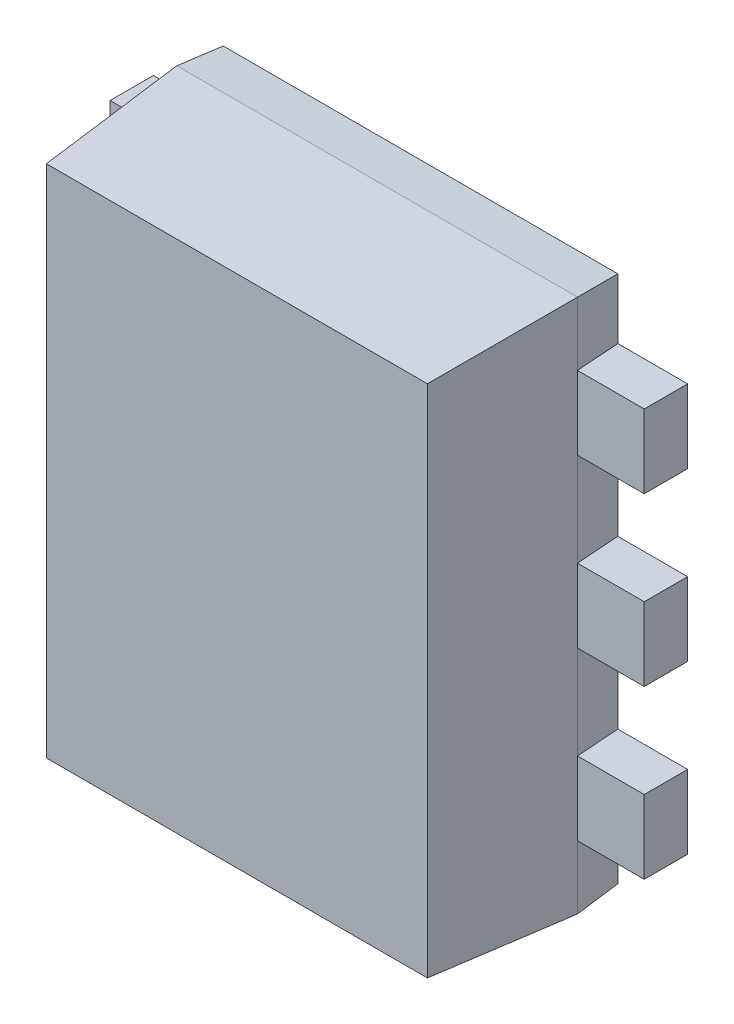
ISO-10303-21;
HEADER;
FILE_DESCRIPTION(('STEP AP214'),'2;1');
FILE_NAME('part.step','',(''),(''),'','','');
FILE_SCHEMA(('AUTOMOTIVE_DESIGN { 1 0 10303 214 1 1 1 1 }'));
ENDSEC;
DATA;
#1=APPLICATION_CONTEXT('core data for automotive mechanical design processes');
#2=APPLICATION_PROTOCOL_DEFINITION('international standard','automotive_design',2000,#1);
#3=PRODUCT_CONTEXT('',#1,'mechanical');
#4=PRODUCT('Part','Part','',(#3));
#5=PRODUCT_RELATED_PRODUCT_CATEGORY('part','',(#4));
#6=PRODUCT_DEFINITION_FORMATION('','',#4);
#7=PRODUCT_DEFINITION_CONTEXT('part definition',#1,'design');
#8=PRODUCT_DEFINITION('design','',#6,#7);
#9=PRODUCT_DEFINITION_SHAPE('','',#8);
#10=(LENGTH_UNIT() NAMED_UNIT(*) SI_UNIT(.MILLI.,.METRE.));
#11=(NAMED_UNIT(*) PLANE_ANGLE_UNIT() SI_UNIT($,.RADIAN.));
#12=(NAMED_UNIT(*) SI_UNIT($,.STERADIAN.) SOLID_ANGLE_UNIT());
#13=UNCERTAINTY_MEASURE_WITH_UNIT(LENGTH_MEASURE(1.E-05),#10,'distance_accuracy_value','');
#14=(GEOMETRIC_REPRESENTATION_CONTEXT(3) GLOBAL_UNCERTAINTY_ASSIGNED_CONTEXT((#13)) GLOBAL_UNIT_ASSIGNED_CONTEXT((#10,
#11,#12)) REPRESENTATION_CONTEXT('',''));
#15=CARTESIAN_POINT('',(0.,0.,0.));
#16=DIRECTION('',(0.,0.,1.));
#17=DIRECTION('',(1.,0.,0.));
#18=AXIS2_PLACEMENT_3D('',#15,#16,#17);
#19=CARTESIAN_POINT('',(0.590909514447,-0.61,0.13));
#20=DIRECTION('',(0.,0.,1.));
#21=DIRECTION('',(1.,0.,0.));
#22=AXIS2_PLACEMENT_3D('',#19,#20,#21);
#23=PLANE('',#22);
#24=DIRECTION('',(0.,1.,0.));
#25=VECTOR('',#24,1.);
#26=CARTESIAN_POINT('',(0.8,-0.61,0.13));
#27=LINE('',#26,#25);
#28=CARTESIAN_POINT('',(0.8,-0.39,0.13));
#29=VERTEX_POINT('',#28);
#30=CARTESIAN_POINT('',(0.8,-0.61,0.13));
#31=VERTEX_POINT('',#30);
#32=EDGE_CURVE('E358',#29,#31,#27,.F.);
#33=ORIENTED_EDGE('',*,*,#32,.F.);
#34=DIRECTION('',(-1.,0.,0.));
#35=VECTOR('',#34,1.);
#36=CARTESIAN_POINT('',(0.590909514447,-0.39,0.13));
#37=LINE('',#36,#35);
#38=CARTESIAN_POINT('',(0.6,-0.39,0.13));
#39=VERTEX_POINT('',#38);
#40=EDGE_CURVE('E367',#39,#29,#37,.F.);
#41=ORIENTED_EDGE('',*,*,#40,.F.);
#42=DIRECTION('',(0.,1.,0.));
#43=VECTOR('',#42,1.);
#44=CARTESIAN_POINT('',(0.6,0.,0.13));
#45=LINE('',#44,#43);
#46=CARTESIAN_POINT('',(0.6,-0.61,0.13));
#47=VERTEX_POINT('',#46);
#48=EDGE_CURVE('E339',#47,#39,#45,.T.);
#49=ORIENTED_EDGE('',*,*,#48,.F.);
#50=DIRECTION('',(-1.,0.,0.));
#51=VECTOR('',#50,1.);
#52=CARTESIAN_POINT('',(0.590909514447,-0.61,0.13));
#53=LINE('',#52,#51);
#54=EDGE_CURVE('E344',#47,#31,#53,.F.);
#55=ORIENTED_EDGE('',*,*,#54,.T.);
#56=EDGE_LOOP('',(#33,#41,#49,#55));
#57=FACE_BOUND('',#56,.T.);
#58=ADVANCED_FACE('F17',(#57),#23,.T.);
#59=CARTESIAN_POINT('',(0.590909514447,-0.11,0.13));
#60=DIRECTION('',(0.,0.,1.));
#61=DIRECTION('',(1.,0.,0.));
#62=AXIS2_PLACEMENT_3D('',#59,#60,#61);
#63=PLANE('',#62);
#64=DIRECTION('',(0.,1.,0.));
#65=VECTOR('',#64,1.);
#66=CARTESIAN_POINT('',(0.8,-0.11,0.13));
#67=LINE('',#66,#65);
#68=CARTESIAN_POINT('',(0.8,0.11,0.13));
#69=VERTEX_POINT('',#68);
#70=CARTESIAN_POINT('',(0.8,-0.11,0.13));
#71=VERTEX_POINT('',#70);
#72=EDGE_CURVE('E376',#69,#71,#67,.F.);
#73=ORIENTED_EDGE('',*,*,#72,.F.);
#74=DIRECTION('',(-1.,0.,0.));
#75=VECTOR('',#74,1.);
#76=CARTESIAN_POINT('',(0.590909514447,0.11,0.13));
#77=LINE('',#76,#75);
#78=CARTESIAN_POINT('',(0.6,0.11,0.13));
#79=VERTEX_POINT('',#78);
#80=EDGE_CURVE('E375',#79,#69,#77,.F.);
#81=ORIENTED_EDGE('',*,*,#80,.F.);
#82=DIRECTION('',(0.,1.,0.));
#83=VECTOR('',#82,1.);
#84=CARTESIAN_POINT('',(0.6,0.,0.13));
#85=LINE('',#84,#83);
#86=CARTESIAN_POINT('',(0.6,-0.11,0.13));
#87=VERTEX_POINT('',#86);
#88=EDGE_CURVE('E342',#87,#79,#85,.T.);
#89=ORIENTED_EDGE('',*,*,#88,.F.);
#90=DIRECTION('',(-1.,0.,0.));
#91=VECTOR('',#90,1.);
#92=CARTESIAN_POINT('',(0.590909514447,-0.11,0.13));
#93=LINE('',#92,#91);
#94=EDGE_CURVE('E359',#87,#71,#93,.F.);
#95=ORIENTED_EDGE('',*,*,#94,.T.);
#96=EDGE_LOOP('',(#73,#81,#89,#95));
#97=FACE_BOUND('',#96,.T.);
#98=ADVANCED_FACE('F572',(#97),#63,.T.);
#99=CARTESIAN_POINT('',(0.590909514447,0.39,0.13));
#100=DIRECTION('',(0.,0.,1.));
#101=DIRECTION('',(1.,0.,0.));
#102=AXIS2_PLACEMENT_3D('',#99,#100,#101);
#103=PLANE('',#102);
#104=DIRECTION('',(0.,1.,0.));
#105=VECTOR('',#104,1.);
#106=CARTESIAN_POINT('',(0.8,0.39,0.13));
#107=LINE('',#106,#105);
#108=CARTESIAN_POINT('',(0.8,0.61,0.13));
#109=VERTEX_POINT('',#108);
#110=CARTESIAN_POINT('',(0.8,0.39,0.13));
#111=VERTEX_POINT('',#110);
#112=EDGE_CURVE('E420',#109,#111,#107,.F.);
#113=ORIENTED_EDGE('',*,*,#112,.F.);
#114=DIRECTION('',(-1.,0.,0.));
#115=VECTOR('',#114,1.);
#116=CARTESIAN_POINT('',(0.590909514447,0.61,0.13));
#117=LINE('',#116,#115);
#118=CARTESIAN_POINT('',(0.6,0.61,0.13));
#119=VERTEX_POINT('',#118);
#120=EDGE_CURVE('E417',#119,#109,#117,.F.);
#121=ORIENTED_EDGE('',*,*,#120,.F.);
#122=DIRECTION('',(0.,1.,0.));
#123=VECTOR('',#122,1.);
#124=CARTESIAN_POINT('',(0.6,0.,0.13));
#125=LINE('',#124,#123);
#126=CARTESIAN_POINT('',(0.6,0.39,0.13));
#127=VERTEX_POINT('',#126);
#128=EDGE_CURVE('E322',#127,#119,#125,.T.);
#129=ORIENTED_EDGE('',*,*,#128,.F.);
#130=DIRECTION('',(-1.,0.,0.));
#131=VECTOR('',#130,1.);
#132=CARTESIAN_POINT('',(0.590909514447,0.39,0.13));
#133=LINE('',#132,#131);
#134=EDGE_CURVE('E397',#127,#111,#133,.F.);
#135=ORIENTED_EDGE('',*,*,#134,.T.);
#136=EDGE_LOOP('',(#113,#121,#129,#135));
#137=FACE_BOUND('',#136,.T.);
#138=ADVANCED_FACE('F622',(#137),#103,.T.);
#139=CARTESIAN_POINT('',(-0.590909514447,0.11,0.13));
#140=DIRECTION('',(0.,0.,1.));
#141=DIRECTION('',(1.,0.,0.));
#142=AXIS2_PLACEMENT_3D('',#139,#140,#141);
#143=PLANE('',#142);
#144=DIRECTION('',(0.,-1.,0.));
#145=VECTOR('',#144,1.);
#146=CARTESIAN_POINT('',(-0.8,0.11,0.13));
#147=LINE('',#146,#145);
#148=CARTESIAN_POINT('',(-0.8,-0.11,0.13));
#149=VERTEX_POINT('',#148);
#150=CARTESIAN_POINT('',(-0.8,0.11,0.13));
#151=VERTEX_POINT('',#150);
#152=EDGE_CURVE('E263',#149,#151,#147,.F.);
#153=ORIENTED_EDGE('',*,*,#152,.F.);
#154=DIRECTION('',(1.,0.,0.));
#155=VECTOR('',#154,1.);
#156=CARTESIAN_POINT('',(-0.590909514447,-0.11,0.13));
#157=LINE('',#156,#155);
#158=CARTESIAN_POINT('',(-0.6,-0.11,0.13));
#159=VERTEX_POINT('',#158);
#160=EDGE_CURVE('E262',#159,#149,#157,.F.);
#161=ORIENTED_EDGE('',*,*,#160,.F.);
#162=DIRECTION('',(0.,-1.,0.));
#163=VECTOR('',#162,1.);
#164=CARTESIAN_POINT('',(-0.6,0.,0.13));
#165=LINE('',#164,#163);
#166=CARTESIAN_POINT('',(-0.6,0.11,0.13));
#167=VERTEX_POINT('',#166);
#168=EDGE_CURVE('E215',#167,#159,#165,.T.);
#169=ORIENTED_EDGE('',*,*,#168,.F.);
#170=DIRECTION('',(1.,0.,0.));
#171=VECTOR('',#170,1.);
#172=CARTESIAN_POINT('',(-0.590909514447,0.11,0.13));
#173=LINE('',#172,#171);
#174=EDGE_CURVE('E261',#167,#151,#173,.F.);
#175=ORIENTED_EDGE('',*,*,#174,.T.);
#176=EDGE_LOOP('',(#153,#161,#169,#175));
#177=FACE_BOUND('',#176,.T.);
#178=ADVANCED_FACE('F967',(#177),#143,.T.);
#179=CARTESIAN_POINT('',(-0.590909514447,-0.39,0.13));
#180=DIRECTION('',(0.,0.,1.));
#181=DIRECTION('',(1.,0.,0.));
#182=AXIS2_PLACEMENT_3D('',#179,#180,#181);
#183=PLANE('',#182);
#184=DIRECTION('',(0.,-1.,0.));
#185=VECTOR('',#184,1.);
#186=CARTESIAN_POINT('',(-0.8,-0.39,0.13));
#187=LINE('',#186,#185);
#188=CARTESIAN_POINT('',(-0.8,-0.61,0.13));
#189=VERTEX_POINT('',#188);
#190=CARTESIAN_POINT('',(-0.8,-0.39,0.13));
#191=VERTEX_POINT('',#190);
#192=EDGE_CURVE('E309',#189,#191,#187,.F.);
#193=ORIENTED_EDGE('',*,*,#192,.F.);
#194=DIRECTION('',(1.,0.,0.));
#195=VECTOR('',#194,1.);
#196=CARTESIAN_POINT('',(-0.590909514447,-0.61,0.13));
#197=LINE('',#196,#195);
#198=CARTESIAN_POINT('',(-0.6,-0.61,0.13));
#199=VERTEX_POINT('',#198);
#200=EDGE_CURVE('E306',#199,#189,#197,.F.);
#201=ORIENTED_EDGE('',*,*,#200,.F.);
#202=DIRECTION('',(0.,-1.,0.));
#203=VECTOR('',#202,1.);
#204=CARTESIAN_POINT('',(-0.6,0.,0.13));
#205=LINE('',#204,#203);
#206=CARTESIAN_POINT('',(-0.6,-0.39,0.13));
#207=VERTEX_POINT('',#206);
#208=EDGE_CURVE('E282',#207,#199,#205,.T.);
#209=ORIENTED_EDGE('',*,*,#208,.F.);
#210=DIRECTION('',(1.,0.,0.));
#211=VECTOR('',#210,1.);
#212=CARTESIAN_POINT('',(-0.590909514447,-0.39,0.13));
#213=LINE('',#212,#211);
#214=EDGE_CURVE('E286',#207,#191,#213,.F.);
#215=ORIENTED_EDGE('',*,*,#214,.T.);
#216=EDGE_LOOP('',(#193,#201,#209,#215));
#217=FACE_BOUND('',#216,.T.);
#218=ADVANCED_FACE('F958',(#217),#183,.T.);
#219=CARTESIAN_POINT('',(-0.570630738984,0.770630738984,0.55));
#220=DIRECTION('',(0.,0.,-1.));
#221=DIRECTION('',(-1.,0.,0.));
#222=AXIS2_PLACEMENT_3D('',#219,#220,#221);
#223=PLANE('',#222);
#224=DIRECTION('',(-1.,0.,0.));
#225=VECTOR('',#224,1.);
#226=CARTESIAN_POINT('',(0.,-0.770630738984,0.55));
#227=LINE('',#226,#225);
#228=CARTESIAN_POINT('',(0.570630738984,-0.770630738984,0.55));
#229=VERTEX_POINT('',#228);
#230=CARTESIAN_POINT('',(-0.570630738984,-0.770630738984,0.55));
#231=VERTEX_POINT('',#230);
#232=EDGE_CURVE('E312',#229,#231,#227,.T.);
#233=ORIENTED_EDGE('',*,*,#232,.F.);
#234=DIRECTION('',(0.,-1.,0.));
#235=VECTOR('',#234,1.);
#236=CARTESIAN_POINT('',(0.570630738984,0.,0.55));
#237=LINE('',#236,#235);
#238=CARTESIAN_POINT('',(0.570630738984,0.770630738984,0.55));
#239=VERTEX_POINT('',#238);
#240=EDGE_CURVE('E317',#239,#229,#237,.T.);
#241=ORIENTED_EDGE('',*,*,#240,.F.);
#242=DIRECTION('',(1.,0.,0.));
#243=VECTOR('',#242,1.);
#244=CARTESIAN_POINT('',(0.,0.770630738984,0.55));
#245=LINE('',#244,#243);
#246=CARTESIAN_POINT('',(-0.570630738984,0.770630738984,0.55));
#247=VERTEX_POINT('',#246);
#248=EDGE_CURVE('E423',#247,#239,#245,.T.);
#249=ORIENTED_EDGE('',*,*,#248,.F.);
#250=DIRECTION('',(0.,1.,0.));
#251=VECTOR('',#250,1.);
#252=CARTESIAN_POINT('',(-0.570630738984,0.,0.55));
#253=LINE('',#252,#251);
#254=EDGE_CURVE('E528',#231,#247,#253,.T.);
#255=ORIENTED_EDGE('',*,*,#254,.F.);
#256=EDGE_LOOP('',(#233,#241,#249,#255));
#257=FACE_BOUND('',#256,.T.);
#258=ADVANCED_FACE('F950',(#257),#223,.F.);
#259=CARTESIAN_POINT('',(-0.590909514447,0.61,0.13));
#260=DIRECTION('',(0.,0.,1.));
#261=DIRECTION('',(1.,0.,0.));
#262=AXIS2_PLACEMENT_3D('',#259,#260,#261);
#263=PLANE('',#262);
#264=DIRECTION('',(0.,-1.,0.));
#265=VECTOR('',#264,1.);
#266=CARTESIAN_POINT('',(-0.8,0.61,0.13));
#267=LINE('',#266,#265);
#268=CARTESIAN_POINT('',(-0.8,0.39,0.13));
#269=VERTEX_POINT('',#268);
#270=CARTESIAN_POINT('',(-0.8,0.61,0.13));
#271=VERTEX_POINT('',#270);
#272=EDGE_CURVE('E226',#269,#271,#267,.F.);
#273=ORIENTED_EDGE('',*,*,#272,.F.);
#274=DIRECTION('',(1.,0.,0.));
#275=VECTOR('',#274,1.);
#276=CARTESIAN_POINT('',(-0.590909514447,0.39,0.13));
#277=LINE('',#276,#275);
#278=CARTESIAN_POINT('',(-0.6,0.39,0.13));
#279=VERTEX_POINT('',#278);
#280=EDGE_CURVE('E221',#279,#269,#277,.F.);
#281=ORIENTED_EDGE('',*,*,#280,.F.);
#282=DIRECTION('',(0.,-1.,0.));
#283=VECTOR('',#282,1.);
#284=CARTESIAN_POINT('',(-0.6,0.,0.13));
#285=LINE('',#284,#283);
#286=CARTESIAN_POINT('',(-0.6,0.61,0.13));
#287=VERTEX_POINT('',#286);
#288=EDGE_CURVE('E224',#287,#279,#285,.T.);
#289=ORIENTED_EDGE('',*,*,#288,.F.);
#290=DIRECTION('',(1.,0.,0.));
#291=VECTOR('',#290,1.);
#292=CARTESIAN_POINT('',(-0.590909514447,0.61,0.13));
#293=LINE('',#292,#291);
#294=EDGE_CURVE('E431',#287,#271,#293,.F.);
#295=ORIENTED_EDGE('',*,*,#294,.T.);
#296=EDGE_LOOP('',(#273,#281,#289,#295));
#297=FACE_BOUND('',#296,.T.);
#298=ADVANCED_FACE('F222',(#297),#263,.T.);
#299=CARTESIAN_POINT('',(0.6,0.8,0.13));
#300=DIRECTION('',(0.,0.99756405025987,0.0697564737434767));
#301=DIRECTION('',(-1.,0.,0.));
#302=AXIS2_PLACEMENT_3D('',#299,#300,#301);
#303=PLANE('',#302);
#304=ORIENTED_EDGE('',*,*,#248,.T.);
#305=DIRECTION('',(-0.0695873743160207,-0.0695873743160207,0.995145815783599));
#306=VECTOR('',#305,1.);
#307=CARTESIAN_POINT('',(0.585315369492,0.785315369492,0.34));
#308=LINE('',#307,#306);
#309=CARTESIAN_POINT('',(0.6,0.8,0.13));
#310=VERTEX_POINT('',#309);
#311=EDGE_CURVE('E319',#310,#239,#308,.T.);
#312=ORIENTED_EDGE('',*,*,#311,.F.);
#313=DIRECTION('',(1.,0.,0.));
#314=VECTOR('',#313,1.);
#315=CARTESIAN_POINT('',(0.,0.8,0.13));
#316=LINE('',#315,#314);
#317=CARTESIAN_POINT('',(-0.6,0.8,0.13));
#318=VERTEX_POINT('',#317);
#319=EDGE_CURVE('E511',#318,#310,#316,.T.);
#320=ORIENTED_EDGE('',*,*,#319,.F.);
#321=DIRECTION('',(-0.0695873743160207,0.0695873743160207,-0.995145815783599));
#322=VECTOR('',#321,1.);
#323=CARTESIAN_POINT('',(-0.585315369492,0.785315369492,0.34));
#324=LINE('',#323,#322);
#325=EDGE_CURVE('E434',#247,#318,#324,.T.);
#326=ORIENTED_EDGE('',*,*,#325,.F.);
#327=EDGE_LOOP('',(#304,#312,#320,#326));
#328=FACE_BOUND('',#327,.T.);
#329=ADVANCED_FACE('F617',(#328),#303,.T.);
#330=CARTESIAN_POINT('',(0.8,0.39,0.));
#331=DIRECTION('',(1.,0.,0.));
#332=DIRECTION('',(0.,1.,0.));
#333=AXIS2_PLACEMENT_3D('',#330,#331,#332);
#334=PLANE('',#333);
#335=DIRECTION('',(0.,0.,1.));
#336=VECTOR('',#335,1.);
#337=CARTESIAN_POINT('',(0.8,0.61,0.));
#338=LINE('',#337,#336);
#339=CARTESIAN_POINT('',(0.8,0.61,0.));
#340=VERTEX_POINT('',#339);
#341=EDGE_CURVE('E399',#109,#340,#338,.F.);
#342=ORIENTED_EDGE('',*,*,#341,.F.);
#343=ORIENTED_EDGE('',*,*,#112,.T.);
#344=DIRECTION('',(0.,0.,1.));
#345=VECTOR('',#344,1.);
#346=CARTESIAN_POINT('',(0.8,0.39,0.));
#347=LINE('',#346,#345);
#348=CARTESIAN_POINT('',(0.8,0.39,0.));
#349=VERTEX_POINT('',#348);
#350=EDGE_CURVE('E379',#111,#349,#347,.F.);
#351=ORIENTED_EDGE('',*,*,#350,.T.);
#352=DIRECTION('',(0.,1.,0.));
#353=VECTOR('',#352,1.);
#354=CARTESIAN_POINT('',(0.8,0.39,0.));
#355=LINE('',#354,#353);
#356=EDGE_CURVE('E383',#349,#340,#355,.T.);
#357=ORIENTED_EDGE('',*,*,#356,.T.);
#358=EDGE_LOOP('',(#342,#343,#351,#357));
#359=FACE_BOUND('',#358,.T.);
#360=ADVANCED_FACE('F628',(#359),#334,.T.);
#361=CARTESIAN_POINT('',(0.590909514447,0.61,0.));
#362=DIRECTION('',(0.,1.,0.));
#363=DIRECTION('',(-1.,0.,0.));
#364=AXIS2_PLACEMENT_3D('',#361,#362,#363);
#365=PLANE('',#364);
#366=ORIENTED_EDGE('',*,*,#120,.T.);
#367=ORIENTED_EDGE('',*,*,#341,.T.);
#368=DIRECTION('',(1.,0.,0.));
#369=VECTOR('',#368,1.);
#370=CARTESIAN_POINT('',(0.590909514447,0.61,0.));
#371=LINE('',#370,#369);
#372=CARTESIAN_POINT('',(0.590909514447,0.61,0.));
#373=VERTEX_POINT('',#372);
#374=EDGE_CURVE('E406',#340,#373,#371,.F.);
#375=ORIENTED_EDGE('',*,*,#374,.T.);
#376=DIRECTION('',(0.069756473746749,0.,0.997564050259641));
#377=VECTOR('',#376,1.);
#378=CARTESIAN_POINT('',(0.590909514447,0.61,0.));
#379=LINE('',#378,#377);
#380=EDGE_CURVE('E509',#119,#373,#379,.F.);
#381=ORIENTED_EDGE('',*,*,#380,.F.);
#382=EDGE_LOOP('',(#366,#367,#375,#381));
#383=FACE_BOUND('',#382,.T.);
#384=ADVANCED_FACE('F630',(#383),#365,.T.);
#385=CARTESIAN_POINT('',(0.590909514447,0.39,0.));
#386=DIRECTION('',(0.,1.,0.));
#387=DIRECTION('',(-1.,0.,0.));
#388=AXIS2_PLACEMENT_3D('',#385,#386,#387);
#389=PLANE('',#388);
#390=ORIENTED_EDGE('',*,*,#134,.F.);
#391=DIRECTION('',(0.069756473746749,0.,0.997564050259641));
#392=VECTOR('',#391,1.);
#393=CARTESIAN_POINT('',(0.590909514447,0.39,0.));
#394=LINE('',#393,#392);
#395=CARTESIAN_POINT('',(0.590909514447,0.39,0.));
#396=VERTEX_POINT('',#395);
#397=EDGE_CURVE('E394',#396,#127,#394,.T.);
#398=ORIENTED_EDGE('',*,*,#397,.F.);
#399=DIRECTION('',(1.,0.,0.));
#400=VECTOR('',#399,1.);
#401=CARTESIAN_POINT('',(0.590909514447,0.39,0.));
#402=LINE('',#401,#400);
#403=EDGE_CURVE('E380',#396,#349,#402,.T.);
#404=ORIENTED_EDGE('',*,*,#403,.T.);
#405=ORIENTED_EDGE('',*,*,#350,.F.);
#406=EDGE_LOOP('',(#390,#398,#404,#405));
#407=FACE_BOUND('',#406,.T.);
#408=ADVANCED_FACE('F625',(#407),#389,.F.);
#409=CARTESIAN_POINT('',(0.8,-0.11,0.));
#410=DIRECTION('',(1.,0.,0.));
#411=DIRECTION('',(0.,1.,0.));
#412=AXIS2_PLACEMENT_3D('',#409,#410,#411);
#413=PLANE('',#412);
#414=DIRECTION('',(0.,0.,1.));
#415=VECTOR('',#414,1.);
#416=CARTESIAN_POINT('',(0.8,0.11,0.));
#417=LINE('',#416,#415);
#418=CARTESIAN_POINT('',(0.8,0.11,0.));
#419=VERTEX_POINT('',#418);
#420=EDGE_CURVE('E372',#69,#419,#417,.F.);
#421=ORIENTED_EDGE('',*,*,#420,.F.);
#422=ORIENTED_EDGE('',*,*,#72,.T.);
#423=DIRECTION('',(0.,0.,1.));
#424=VECTOR('',#423,1.);
#425=CARTESIAN_POINT('',(0.8,-0.11,0.));
#426=LINE('',#425,#424);
#427=CARTESIAN_POINT('',(0.8,-0.11,0.));
#428=VERTEX_POINT('',#427);
#429=EDGE_CURVE('E356',#71,#428,#426,.F.);
#430=ORIENTED_EDGE('',*,*,#429,.T.);
#431=DIRECTION('',(0.,1.,0.));
#432=VECTOR('',#431,1.);
#433=CARTESIAN_POINT('',(0.8,-0.11,0.));
#434=LINE('',#433,#432);
#435=EDGE_CURVE('E480',#428,#419,#434,.T.);
#436=ORIENTED_EDGE('',*,*,#435,.T.);
#437=EDGE_LOOP('',(#421,#422,#430,#436));
#438=FACE_BOUND('',#437,.T.);
#439=ADVANCED_FACE('F554',(#438),#413,.T.);
#440=CARTESIAN_POINT('',(0.590909514447,0.11,0.));
#441=DIRECTION('',(0.,1.,0.));
#442=DIRECTION('',(-1.,0.,0.));
#443=AXIS2_PLACEMENT_3D('',#440,#441,#442);
#444=PLANE('',#443);
#445=ORIENTED_EDGE('',*,*,#80,.T.);
#446=ORIENTED_EDGE('',*,*,#420,.T.);
#447=DIRECTION('',(1.,0.,0.));
#448=VECTOR('',#447,1.);
#449=CARTESIAN_POINT('',(0.590909514447,0.11,0.));
#450=LINE('',#449,#448);
#451=CARTESIAN_POINT('',(0.590909514447,0.11,0.));
#452=VERTEX_POINT('',#451);
#453=EDGE_CURVE('E477',#419,#452,#450,.F.);
#454=ORIENTED_EDGE('',*,*,#453,.T.);
#455=DIRECTION('',(-0.069756473746749,0.,-0.997564050259641));
#456=VECTOR('',#455,1.);
#457=CARTESIAN_POINT('',(0.590909514447,0.11,0.));
#458=LINE('',#457,#456);
#459=EDGE_CURVE('E413',#79,#452,#458,.T.);
#460=ORIENTED_EDGE('',*,*,#459,.F.);
#461=EDGE_LOOP('',(#445,#446,#454,#460));
#462=FACE_BOUND('',#461,.T.);
#463=ADVANCED_FACE('F559',(#462),#444,.T.);
#464=CARTESIAN_POINT('',(0.590909514447,-0.11,0.));
#465=DIRECTION('',(0.,1.,0.));
#466=DIRECTION('',(-1.,0.,0.));
#467=AXIS2_PLACEMENT_3D('',#464,#465,#466);
#468=PLANE('',#467);
#469=ORIENTED_EDGE('',*,*,#94,.F.);
#470=DIRECTION('',(0.069756473746749,0.,0.997564050259641));
#471=VECTOR('',#470,1.);
#472=CARTESIAN_POINT('',(0.590909514447,-0.11,0.));
#473=LINE('',#472,#471);
#474=CARTESIAN_POINT('',(0.590909514447,-0.11,0.));
#475=VERTEX_POINT('',#474);
#476=EDGE_CURVE('E362',#475,#87,#473,.T.);
#477=ORIENTED_EDGE('',*,*,#476,.F.);
#478=DIRECTION('',(1.,0.,0.));
#479=VECTOR('',#478,1.);
#480=CARTESIAN_POINT('',(0.590909514447,-0.11,0.));
#481=LINE('',#480,#479);
#482=EDGE_CURVE('E393',#475,#428,#481,.T.);
#483=ORIENTED_EDGE('',*,*,#482,.T.);
#484=ORIENTED_EDGE('',*,*,#429,.F.);
#485=EDGE_LOOP('',(#469,#477,#483,#484));
#486=FACE_BOUND('',#485,.T.);
#487=ADVANCED_FACE('F574',(#486),#468,.F.);
#488=CARTESIAN_POINT('',(0.8,-0.61,0.));
#489=DIRECTION('',(1.,0.,0.));
#490=DIRECTION('',(0.,1.,0.));
#491=AXIS2_PLACEMENT_3D('',#488,#489,#490);
#492=PLANE('',#491);
#493=DIRECTION('',(0.,0.,1.));
#494=VECTOR('',#493,1.);
#495=CARTESIAN_POINT('',(0.8,-0.39,0.));
#496=LINE('',#495,#494);
#497=CARTESIAN_POINT('',(0.8,-0.39,0.));
#498=VERTEX_POINT('',#497);
#499=EDGE_CURVE('E346',#29,#498,#496,.F.);
#500=ORIENTED_EDGE('',*,*,#499,.F.);
#501=ORIENTED_EDGE('',*,*,#32,.T.);
#502=DIRECTION('',(0.,0.,1.));
#503=VECTOR('',#502,1.);
#504=CARTESIAN_POINT('',(0.8,-0.61,0.));
#505=LINE('',#504,#503);
#506=CARTESIAN_POINT('',(0.8,-0.61,0.));
#507=VERTEX_POINT('',#506);
#508=EDGE_CURVE('E343',#31,#507,#505,.F.);
#509=ORIENTED_EDGE('',*,*,#508,.T.);
#510=DIRECTION('',(0.,1.,0.));
#511=VECTOR('',#510,1.);
#512=CARTESIAN_POINT('',(0.8,-0.61,0.));
#513=LINE('',#512,#511);
#514=EDGE_CURVE('E326',#507,#498,#513,.T.);
#515=ORIENTED_EDGE('',*,*,#514,.T.);
#516=EDGE_LOOP('',(#500,#501,#509,#515));
#517=FACE_BOUND('',#516,.T.);
#518=ADVANCED_FACE('F592',(#517),#492,.T.);
#519=CARTESIAN_POINT('',(0.590909514447,-0.39,0.));
#520=DIRECTION('',(0.,1.,0.));
#521=DIRECTION('',(-1.,0.,0.));
#522=AXIS2_PLACEMENT_3D('',#519,#520,#521);
#523=PLANE('',#522);
#524=ORIENTED_EDGE('',*,*,#40,.T.);
#525=ORIENTED_EDGE('',*,*,#499,.T.);
#526=DIRECTION('',(1.,0.,0.));
#527=VECTOR('',#526,1.);
#528=CARTESIAN_POINT('',(0.590909514447,-0.39,0.));
#529=LINE('',#528,#527);
#530=CARTESIAN_POINT('',(0.590909514447,-0.39,0.));
#531=VERTEX_POINT('',#530);
#532=EDGE_CURVE('E353',#498,#531,#529,.F.);
#533=ORIENTED_EDGE('',*,*,#532,.T.);
#534=DIRECTION('',(0.069756473746749,0.,0.997564050259641));
#535=VECTOR('',#534,1.);
#536=CARTESIAN_POINT('',(0.590909514447,-0.39,0.));
#537=LINE('',#536,#535);
#538=EDGE_CURVE('E479',#39,#531,#537,.F.);
#539=ORIENTED_EDGE('',*,*,#538,.F.);
#540=EDGE_LOOP('',(#524,#525,#533,#539));
#541=FACE_BOUND('',#540,.T.);
#542=ADVANCED_FACE('F581',(#541),#523,.T.);
#543=CARTESIAN_POINT('',(0.590909514447,-0.61,0.));
#544=DIRECTION('',(0.,1.,0.));
#545=DIRECTION('',(-1.,0.,0.));
#546=AXIS2_PLACEMENT_3D('',#543,#544,#545);
#547=PLANE('',#546);
#548=ORIENTED_EDGE('',*,*,#54,.F.);
#549=DIRECTION('',(0.069756473746749,0.,0.997564050259641));
#550=VECTOR('',#549,1.);
#551=CARTESIAN_POINT('',(0.590909514447,-0.61,0.));
#552=LINE('',#551,#550);
#553=CARTESIAN_POINT('',(0.590909514447,-0.61,0.));
#554=VERTEX_POINT('',#553);
#555=EDGE_CURVE('E338',#554,#47,#552,.T.);
#556=ORIENTED_EDGE('',*,*,#555,.F.);
#557=DIRECTION('',(1.,0.,0.));
#558=VECTOR('',#557,1.);
#559=CARTESIAN_POINT('',(0.590909514447,-0.61,0.));
#560=LINE('',#559,#558);
#561=EDGE_CURVE('E323',#554,#507,#560,.T.);
#562=ORIENTED_EDGE('',*,*,#561,.T.);
#563=ORIENTED_EDGE('',*,*,#508,.F.);
#564=EDGE_LOOP('',(#548,#556,#562,#563));
#565=FACE_BOUND('',#564,.T.);
#566=ADVANCED_FACE('F587',(#565),#547,.F.);
#567=CARTESIAN_POINT('',(0.6,-0.8,0.13));
#568=DIRECTION('',(0.99756405025987,0.,0.0697564737434767));
#569=DIRECTION('',(0.,1.,0.));
#570=AXIS2_PLACEMENT_3D('',#567,#568,#569);
#571=PLANE('',#570);
#572=ORIENTED_EDGE('',*,*,#240,.T.);
#573=DIRECTION('',(-0.0695873743160207,0.0695873743160207,0.995145815783599));
#574=VECTOR('',#573,1.);
#575=CARTESIAN_POINT('',(0.585315369492,-0.785315369492,0.34));
#576=LINE('',#575,#574);
#577=CARTESIAN_POINT('',(0.6,-0.8,0.13));
#578=VERTEX_POINT('',#577);
#579=EDGE_CURVE('E314',#578,#229,#576,.T.);
#580=ORIENTED_EDGE('',*,*,#579,.F.);
#581=DIRECTION('',(0.,-1.,0.));
#582=VECTOR('',#581,1.);
#583=CARTESIAN_POINT('',(0.6,0.,0.13));
#584=LINE('',#583,#582);
#585=EDGE_CURVE('E334',#47,#578,#584,.T.);
#586=ORIENTED_EDGE('',*,*,#585,.F.);
#587=ORIENTED_EDGE('',*,*,#48,.T.);
#588=DIRECTION('',(0.,-1.,0.));
#589=VECTOR('',#588,1.);
#590=CARTESIAN_POINT('',(0.6,0.,0.13));
#591=LINE('',#590,#589);
#592=EDGE_CURVE('E327',#87,#39,#591,.T.);
#593=ORIENTED_EDGE('',*,*,#592,.F.);
#594=ORIENTED_EDGE('',*,*,#88,.T.);
#595=DIRECTION('',(0.,-1.,0.));
#596=VECTOR('',#595,1.);
#597=CARTESIAN_POINT('',(0.6,0.,0.13));
#598=LINE('',#597,#596);
#599=EDGE_CURVE('E390',#127,#79,#598,.T.);
#600=ORIENTED_EDGE('',*,*,#599,.F.);
#601=ORIENTED_EDGE('',*,*,#128,.T.);
#602=DIRECTION('',(0.,-1.,0.));
#603=VECTOR('',#602,1.);
#604=CARTESIAN_POINT('',(0.6,0.,0.13));
#605=LINE('',#604,#603);
#606=EDGE_CURVE('E384',#310,#119,#605,.T.);
#607=ORIENTED_EDGE('',*,*,#606,.F.);
#608=ORIENTED_EDGE('',*,*,#311,.T.);
#609=EDGE_LOOP('',(#572,#580,#586,#587,#593,#594,#600,#601,#607,#608));
#610=FACE_BOUND('',#609,.T.);
#611=ADVANCED_FACE('F569',(#610),#571,.T.);
#612=CARTESIAN_POINT('',(-0.6,-0.8,0.13));
#613=DIRECTION('',(0.,-0.99756405025987,0.0697564737434767));
#614=DIRECTION('',(1.,0.,0.));
#615=AXIS2_PLACEMENT_3D('',#612,#613,#614);
#616=PLANE('',#615);
#617=ORIENTED_EDGE('',*,*,#232,.T.);
#618=DIRECTION('',(0.0695873743160207,0.0695873743160207,0.995145815783599));
#619=VECTOR('',#618,1.);
#620=CARTESIAN_POINT('',(-0.585315369492,-0.785315369492,0.34));
#621=LINE('',#620,#619);
#622=CARTESIAN_POINT('',(-0.6,-0.8,0.13));
#623=VERTEX_POINT('',#622);
#624=EDGE_CURVE('E285',#623,#231,#621,.T.);
#625=ORIENTED_EDGE('',*,*,#624,.F.);
#626=DIRECTION('',(-1.,0.,0.));
#627=VECTOR('',#626,1.);
#628=CARTESIAN_POINT('',(0.,-0.8,0.13));
#629=LINE('',#628,#627);
#630=EDGE_CURVE('E499',#578,#623,#629,.T.);
#631=ORIENTED_EDGE('',*,*,#630,.F.);
#632=ORIENTED_EDGE('',*,*,#579,.T.);
#633=EDGE_LOOP('',(#617,#625,#631,#632));
#634=FACE_BOUND('',#633,.T.);
#635=ADVANCED_FACE('F674',(#634),#616,.T.);
#636=CARTESIAN_POINT('',(-0.8,-0.39,0.));
#637=DIRECTION('',(-1.,0.,0.));
#638=DIRECTION('',(0.,-1.,0.));
#639=AXIS2_PLACEMENT_3D('',#636,#637,#638);
#640=PLANE('',#639);
#641=DIRECTION('',(0.,0.,1.));
#642=VECTOR('',#641,1.);
#643=CARTESIAN_POINT('',(-0.8,-0.61,0.));
#644=LINE('',#643,#642);
#645=CARTESIAN_POINT('',(-0.8,-0.61,0.));
#646=VERTEX_POINT('',#645);
#647=EDGE_CURVE('E288',#189,#646,#644,.F.);
#648=ORIENTED_EDGE('',*,*,#647,.F.);
#649=ORIENTED_EDGE('',*,*,#192,.T.);
#650=DIRECTION('',(0.,0.,1.));
#651=VECTOR('',#650,1.);
#652=CARTESIAN_POINT('',(-0.8,-0.39,0.));
#653=LINE('',#652,#651);
#654=CARTESIAN_POINT('',(-0.8,-0.39,0.));
#655=VERTEX_POINT('',#654);
#656=EDGE_CURVE('E266',#191,#655,#653,.F.);
#657=ORIENTED_EDGE('',*,*,#656,.T.);
#658=DIRECTION('',(0.,1.,0.));
#659=VECTOR('',#658,1.);
#660=CARTESIAN_POINT('',(-0.8,-0.39,0.));
#661=LINE('',#660,#659);
#662=EDGE_CURVE('E270',#655,#646,#661,.F.);
#663=ORIENTED_EDGE('',*,*,#662,.T.);
#664=EDGE_LOOP('',(#648,#649,#657,#663));
#665=FACE_BOUND('',#664,.T.);
#666=ADVANCED_FACE('F670',(#665),#640,.T.);
#667=CARTESIAN_POINT('',(-0.590909514447,-0.61,0.));
#668=DIRECTION('',(0.,-1.,0.));
#669=DIRECTION('',(1.,0.,0.));
#670=AXIS2_PLACEMENT_3D('',#667,#668,#669);
#671=PLANE('',#670);
#672=ORIENTED_EDGE('',*,*,#200,.T.);
#673=ORIENTED_EDGE('',*,*,#647,.T.);
#674=DIRECTION('',(1.,0.,0.));
#675=VECTOR('',#674,1.);
#676=CARTESIAN_POINT('',(-0.590909514447,-0.61,0.));
#677=LINE('',#676,#675);
#678=CARTESIAN_POINT('',(-0.590909514447,-0.61,0.));
#679=VERTEX_POINT('',#678);
#680=EDGE_CURVE('E295',#646,#679,#677,.T.);
#681=ORIENTED_EDGE('',*,*,#680,.T.);
#682=DIRECTION('',(-0.069756473746749,0.,0.997564050259641));
#683=VECTOR('',#682,1.);
#684=CARTESIAN_POINT('',(-0.590909514447,-0.61,0.));
#685=LINE('',#684,#683);
#686=EDGE_CURVE('E496',#199,#679,#685,.F.);
#687=ORIENTED_EDGE('',*,*,#686,.F.);
#688=EDGE_LOOP('',(#672,#673,#681,#687));
#689=FACE_BOUND('',#688,.T.);
#690=ADVANCED_FACE('F666',(#689),#671,.T.);
#691=CARTESIAN_POINT('',(-0.590909514447,-0.39,0.));
#692=DIRECTION('',(0.,-1.,0.));
#693=DIRECTION('',(1.,0.,0.));
#694=AXIS2_PLACEMENT_3D('',#691,#692,#693);
#695=PLANE('',#694);
#696=ORIENTED_EDGE('',*,*,#214,.F.);
#697=DIRECTION('',(-0.069756473746749,0.,0.997564050259641));
#698=VECTOR('',#697,1.);
#699=CARTESIAN_POINT('',(-0.590909514447,-0.39,0.));
#700=LINE('',#699,#698);
#701=CARTESIAN_POINT('',(-0.590909514447,-0.39,0.));
#702=VERTEX_POINT('',#701);
#703=EDGE_CURVE('E281',#702,#207,#700,.T.);
#704=ORIENTED_EDGE('',*,*,#703,.F.);
#705=DIRECTION('',(1.,0.,0.));
#706=VECTOR('',#705,1.);
#707=CARTESIAN_POINT('',(-0.590909514447,-0.39,0.));
#708=LINE('',#707,#706);
#709=EDGE_CURVE('E267',#702,#655,#708,.F.);
#710=ORIENTED_EDGE('',*,*,#709,.T.);
#711=ORIENTED_EDGE('',*,*,#656,.F.);
#712=EDGE_LOOP('',(#696,#704,#710,#711));
#713=FACE_BOUND('',#712,.T.);
#714=ADVANCED_FACE('F663',(#713),#695,.F.);
#715=CARTESIAN_POINT('',(-0.8,0.11,0.));
#716=DIRECTION('',(-1.,0.,0.));
#717=DIRECTION('',(0.,-1.,0.));
#718=AXIS2_PLACEMENT_3D('',#715,#716,#717);
#719=PLANE('',#718);
#720=DIRECTION('',(0.,0.,1.));
#721=VECTOR('',#720,1.);
#722=CARTESIAN_POINT('',(-0.8,-0.11,0.));
#723=LINE('',#722,#721);
#724=CARTESIAN_POINT('',(-0.8,-0.11,0.));
#725=VERTEX_POINT('',#724);
#726=EDGE_CURVE('E258',#149,#725,#723,.F.);
#727=ORIENTED_EDGE('',*,*,#726,.F.);
#728=ORIENTED_EDGE('',*,*,#152,.T.);
#729=DIRECTION('',(0.,0.,1.));
#730=VECTOR('',#729,1.);
#731=CARTESIAN_POINT('',(-0.8,0.11,0.));
#732=LINE('',#731,#730);
#733=CARTESIAN_POINT('',(-0.8,0.11,0.));
#734=VERTEX_POINT('',#733);
#735=EDGE_CURVE('E246',#151,#734,#732,.F.);
#736=ORIENTED_EDGE('',*,*,#735,.T.);
#737=DIRECTION('',(0.,1.,0.));
#738=VECTOR('',#737,1.);
#739=CARTESIAN_POINT('',(-0.8,0.11,0.));
#740=LINE('',#739,#738);
#741=EDGE_CURVE('E488',#734,#725,#740,.F.);
#742=ORIENTED_EDGE('',*,*,#741,.T.);
#743=EDGE_LOOP('',(#727,#728,#736,#742));
#744=FACE_BOUND('',#743,.T.);
#745=ADVANCED_FACE('F534',(#744),#719,.T.);
#746=CARTESIAN_POINT('',(-0.590909514447,-0.11,0.));
#747=DIRECTION('',(0.,-1.,0.));
#748=DIRECTION('',(1.,0.,0.));
#749=AXIS2_PLACEMENT_3D('',#746,#747,#748);
#750=PLANE('',#749);
#751=ORIENTED_EDGE('',*,*,#160,.T.);
#752=ORIENTED_EDGE('',*,*,#726,.T.);
#753=DIRECTION('',(1.,0.,0.));
#754=VECTOR('',#753,1.);
#755=CARTESIAN_POINT('',(-0.590909514447,-0.11,0.));
#756=LINE('',#755,#754);
#757=CARTESIAN_POINT('',(-0.590909514447,-0.11,0.));
#758=VERTEX_POINT('',#757);
#759=EDGE_CURVE('E235',#725,#758,#756,.T.);
#760=ORIENTED_EDGE('',*,*,#759,.T.);
#761=DIRECTION('',(0.069756473746749,0.,-0.997564050259641));
#762=VECTOR('',#761,1.);
#763=CARTESIAN_POINT('',(-0.590909514447,-0.11,0.));
#764=LINE('',#763,#762);
#765=EDGE_CURVE('E302',#159,#758,#764,.T.);
#766=ORIENTED_EDGE('',*,*,#765,.F.);
#767=EDGE_LOOP('',(#751,#752,#760,#766));
#768=FACE_BOUND('',#767,.T.);
#769=ADVANCED_FACE('F657',(#768),#750,.T.);
#770=CARTESIAN_POINT('',(-0.590909514447,0.11,0.));
#771=DIRECTION('',(0.,-1.,0.));
#772=DIRECTION('',(1.,0.,0.));
#773=AXIS2_PLACEMENT_3D('',#770,#771,#772);
#774=PLANE('',#773);
#775=ORIENTED_EDGE('',*,*,#174,.F.);
#776=DIRECTION('',(-0.069756473746749,0.,0.997564050259641));
#777=VECTOR('',#776,1.);
#778=CARTESIAN_POINT('',(-0.590909514447,0.11,0.));
#779=LINE('',#778,#777);
#780=CARTESIAN_POINT('',(-0.590909514447,0.11,0.));
#781=VERTEX_POINT('',#780);
#782=EDGE_CURVE('E234',#781,#167,#779,.T.);
#783=ORIENTED_EDGE('',*,*,#782,.F.);
#784=DIRECTION('',(1.,0.,0.));
#785=VECTOR('',#784,1.);
#786=CARTESIAN_POINT('',(-0.590909514447,0.11,0.));
#787=LINE('',#786,#785);
#788=EDGE_CURVE('E280',#781,#734,#787,.F.);
#789=ORIENTED_EDGE('',*,*,#788,.T.);
#790=ORIENTED_EDGE('',*,*,#735,.F.);
#791=EDGE_LOOP('',(#775,#783,#789,#790));
#792=FACE_BOUND('',#791,.T.);
#793=ADVANCED_FACE('F538',(#792),#774,.F.);
#794=CARTESIAN_POINT('',(-0.6,0.8,0.13));
#795=DIRECTION('',(-0.99756405025987,0.,0.0697564737434767));
#796=DIRECTION('',(0.,-1.,0.));
#797=AXIS2_PLACEMENT_3D('',#794,#795,#796);
#798=PLANE('',#797);
#799=ORIENTED_EDGE('',*,*,#254,.T.);
#800=ORIENTED_EDGE('',*,*,#325,.T.);
#801=DIRECTION('',(0.,1.,0.));
#802=VECTOR('',#801,1.);
#803=CARTESIAN_POINT('',(-0.6,0.,0.13));
#804=LINE('',#803,#802);
#805=EDGE_CURVE('E245',#287,#318,#804,.T.);
#806=ORIENTED_EDGE('',*,*,#805,.F.);
#807=ORIENTED_EDGE('',*,*,#288,.T.);
#808=DIRECTION('',(0.,1.,0.));
#809=VECTOR('',#808,1.);
#810=CARTESIAN_POINT('',(-0.6,0.,0.13));
#811=LINE('',#810,#809);
#812=EDGE_CURVE('E242',#167,#279,#811,.T.);
#813=ORIENTED_EDGE('',*,*,#812,.F.);
#814=ORIENTED_EDGE('',*,*,#168,.T.);
#815=DIRECTION('',(0.,1.,0.));
#816=VECTOR('',#815,1.);
#817=CARTESIAN_POINT('',(-0.6,0.,0.13));
#818=LINE('',#817,#816);
#819=EDGE_CURVE('E277',#207,#159,#818,.T.);
#820=ORIENTED_EDGE('',*,*,#819,.F.);
#821=ORIENTED_EDGE('',*,*,#208,.T.);
#822=DIRECTION('',(0.,1.,0.));
#823=VECTOR('',#822,1.);
#824=CARTESIAN_POINT('',(-0.6,0.,0.13));
#825=LINE('',#824,#823);
#826=EDGE_CURVE('E271',#623,#199,#825,.T.);
#827=ORIENTED_EDGE('',*,*,#826,.F.);
#828=ORIENTED_EDGE('',*,*,#624,.T.);
#829=EDGE_LOOP('',(#799,#800,#806,#807,#813,#814,#820,#821,#827,#828));
#830=FACE_BOUND('',#829,.T.);
#831=ADVANCED_FACE('F241',(#830),#798,.T.);
#832=CARTESIAN_POINT('',(-0.590909514447,0.61,0.));
#833=DIRECTION('',(0.,-1.,0.));
#834=DIRECTION('',(1.,0.,0.));
#835=AXIS2_PLACEMENT_3D('',#832,#833,#834);
#836=PLANE('',#835);
#837=ORIENTED_EDGE('',*,*,#294,.F.);
#838=DIRECTION('',(-0.069756473746749,0.,0.997564050259641));
#839=VECTOR('',#838,1.);
#840=CARTESIAN_POINT('',(-0.590909514447,0.61,0.));
#841=LINE('',#840,#839);
#842=CARTESIAN_POINT('',(-0.590909514447,0.61,0.));
#843=VERTEX_POINT('',#842);
#844=EDGE_CURVE('E21',#843,#287,#841,.T.);
#845=ORIENTED_EDGE('',*,*,#844,.F.);
#846=DIRECTION('',(1.,0.,0.));
#847=VECTOR('',#846,1.);
#848=CARTESIAN_POINT('',(-0.590909514447,0.61,0.));
#849=LINE('',#848,#847);
#850=CARTESIAN_POINT('',(-0.8,0.61,0.));
#851=VERTEX_POINT('',#850);
#852=EDGE_CURVE('E248',#843,#851,#849,.F.);
#853=ORIENTED_EDGE('',*,*,#852,.T.);
#854=DIRECTION('',(0.,0.,1.));
#855=VECTOR('',#854,1.);
#856=CARTESIAN_POINT('',(-0.8,0.61,0.));
#857=LINE('',#856,#855);
#858=EDGE_CURVE('E433',#271,#851,#857,.F.);
#859=ORIENTED_EDGE('',*,*,#858,.F.);
#860=EDGE_LOOP('',(#837,#845,#853,#859));
#861=FACE_BOUND('',#860,.T.);
#862=ADVANCED_FACE('F652',(#861),#836,.F.);
#863=CARTESIAN_POINT('',(-0.8,0.61,0.));
#864=DIRECTION('',(-1.,0.,0.));
#865=DIRECTION('',(0.,-1.,0.));
#866=AXIS2_PLACEMENT_3D('',#863,#864,#865);
#867=PLANE('',#866);
#868=DIRECTION('',(0.,0.,1.));
#869=VECTOR('',#868,1.);
#870=CARTESIAN_POINT('',(-0.8,0.39,0.));
#871=LINE('',#870,#869);
#872=CARTESIAN_POINT('',(-0.8,0.39,0.));
#873=VERTEX_POINT('',#872);
#874=EDGE_CURVE('E227',#269,#873,#871,.F.);
#875=ORIENTED_EDGE('',*,*,#874,.F.);
#876=ORIENTED_EDGE('',*,*,#272,.T.);
#877=ORIENTED_EDGE('',*,*,#858,.T.);
#878=DIRECTION('',(0.,1.,0.));
#879=VECTOR('',#878,1.);
#880=CARTESIAN_POINT('',(-0.8,0.61,0.));
#881=LINE('',#880,#879);
#882=EDGE_CURVE('E129',#851,#873,#881,.F.);
#883=ORIENTED_EDGE('',*,*,#882,.T.);
#884=EDGE_LOOP('',(#875,#876,#877,#883));
#885=FACE_BOUND('',#884,.T.);
#886=ADVANCED_FACE('F649',(#885),#867,.T.);
#887=CARTESIAN_POINT('',(-0.590909514447,0.39,0.));
#888=DIRECTION('',(0.,-1.,0.));
#889=DIRECTION('',(1.,0.,0.));
#890=AXIS2_PLACEMENT_3D('',#887,#888,#889);
#891=PLANE('',#890);
#892=ORIENTED_EDGE('',*,*,#280,.T.);
#893=ORIENTED_EDGE('',*,*,#874,.T.);
#894=DIRECTION('',(1.,0.,0.));
#895=VECTOR('',#894,1.);
#896=CARTESIAN_POINT('',(-0.590909514447,0.39,0.));
#897=LINE('',#896,#895);
#898=CARTESIAN_POINT('',(-0.590909514447,0.39,0.));
#899=VERTEX_POINT('',#898);
#900=EDGE_CURVE('E36',#873,#899,#897,.T.);
#901=ORIENTED_EDGE('',*,*,#900,.T.);
#902=DIRECTION('',(-0.069756473746749,0.,0.997564050259641));
#903=VECTOR('',#902,1.);
#904=CARTESIAN_POINT('',(-0.590909514447,0.39,0.));
#905=LINE('',#904,#903);
#906=EDGE_CURVE('E229',#279,#899,#905,.F.);
#907=ORIENTED_EDGE('',*,*,#906,.F.);
#908=EDGE_LOOP('',(#892,#893,#901,#907));
#909=FACE_BOUND('',#908,.T.);
#910=ADVANCED_FACE('F230',(#909),#891,.T.);
#911=CARTESIAN_POINT('',(-0.590909514447,0.790909514447,0.));
#912=DIRECTION('',(-0.997564050259641,0.,-0.069756473746749));
#913=DIRECTION('',(0.,-1.,0.));
#914=AXIS2_PLACEMENT_3D('',#911,#912,#913);
#915=PLANE('',#914);
#916=ORIENTED_EDGE('',*,*,#844,.T.);
#917=ORIENTED_EDGE('',*,*,#805,.T.);
#918=DIRECTION('',(-0.0695873743192694,0.0695873743192702,0.995145815783144));
#919=VECTOR('',#918,1.);
#920=CARTESIAN_POINT('',(-0.5954547572235,0.7954547572235,0.065));
#921=LINE('',#920,#919);
#922=CARTESIAN_POINT('',(-0.590909514447,0.790909514447,0.));
#923=VERTEX_POINT('',#922);
#924=EDGE_CURVE('E430',#923,#318,#921,.T.);
#925=ORIENTED_EDGE('',*,*,#924,.F.);
#926=DIRECTION('',(0.,1.,0.));
#927=VECTOR('',#926,1.);
#928=CARTESIAN_POINT('',(-0.590909514447,0.790909514447,0.));
#929=LINE('',#928,#927);
#930=EDGE_CURVE('E254',#843,#923,#929,.T.);
#931=ORIENTED_EDGE('',*,*,#930,.F.);
#932=EDGE_LOOP('',(#916,#917,#925,#931));
#933=FACE_BOUND('',#932,.T.);
#934=ADVANCED_FACE('F614',(#933),#915,.T.);
#935=CARTESIAN_POINT('',(0.590909514447,0.790909514447,0.));
#936=DIRECTION('',(0.,0.997564050259641,-0.0697564737467498));
#937=DIRECTION('',(-1.,0.,0.));
#938=AXIS2_PLACEMENT_3D('',#935,#936,#937);
#939=PLANE('',#938);
#940=ORIENTED_EDGE('',*,*,#319,.T.);
#941=DIRECTION('',(0.0695873743192694,0.0695873743192702,0.995145815783144));
#942=VECTOR('',#941,1.);
#943=CARTESIAN_POINT('',(0.5954547572235,0.7954547572235,0.065));
#944=LINE('',#943,#942);
#945=CARTESIAN_POINT('',(0.590909514447,0.790909514447,0.));
#946=VERTEX_POINT('',#945);
#947=EDGE_CURVE('E411',#946,#310,#944,.T.);
#948=ORIENTED_EDGE('',*,*,#947,.F.);
#949=DIRECTION('',(-1.,0.,0.));
#950=VECTOR('',#949,1.);
#951=CARTESIAN_POINT('',(-0.590909514447,0.790909514447,0.));
#952=LINE('',#951,#950);
#953=EDGE_CURVE('E416',#923,#946,#952,.F.);
#954=ORIENTED_EDGE('',*,*,#953,.F.);
#955=ORIENTED_EDGE('',*,*,#924,.T.);
#956=EDGE_LOOP('',(#940,#948,#954,#955));
#957=FACE_BOUND('',#956,.T.);
#958=ADVANCED_FACE('F608',(#957),#939,.T.);
#959=CARTESIAN_POINT('',(0.590909514447,-0.790909514447,0.));
#960=DIRECTION('',(0.997564050259641,0.,-0.069756473746749));
#961=DIRECTION('',(0.,1.,0.));
#962=AXIS2_PLACEMENT_3D('',#959,#960,#961);
#963=PLANE('',#962);
#964=ORIENTED_EDGE('',*,*,#947,.T.);
#965=ORIENTED_EDGE('',*,*,#606,.T.);
#966=ORIENTED_EDGE('',*,*,#380,.T.);
#967=DIRECTION('',(0.,1.,0.));
#968=VECTOR('',#967,1.);
#969=CARTESIAN_POINT('',(0.590909514447,0.790909514447,0.));
#970=LINE('',#969,#968);
#971=EDGE_CURVE('E389',#946,#373,#970,.F.);
#972=ORIENTED_EDGE('',*,*,#971,.F.);
#973=EDGE_LOOP('',(#964,#965,#966,#972));
#974=FACE_BOUND('',#973,.T.);
#975=ADVANCED_FACE('F610',(#974),#963,.T.);
#976=CARTESIAN_POINT('',(0.590909514447,-0.790909514447,0.));
#977=DIRECTION('',(0.997564050259641,0.,-0.069756473746749));
#978=DIRECTION('',(0.,1.,0.));
#979=AXIS2_PLACEMENT_3D('',#976,#977,#978);
#980=PLANE('',#979);
#981=ORIENTED_EDGE('',*,*,#397,.T.);
#982=ORIENTED_EDGE('',*,*,#599,.T.);
#983=ORIENTED_EDGE('',*,*,#459,.T.);
#984=DIRECTION('',(0.,1.,0.));
#985=VECTOR('',#984,1.);
#986=CARTESIAN_POINT('',(0.590909514447,0.790909514447,0.));
#987=LINE('',#986,#985);
#988=EDGE_CURVE('E366',#396,#452,#987,.F.);
#989=ORIENTED_EDGE('',*,*,#988,.F.);
#990=EDGE_LOOP('',(#981,#982,#983,#989));
#991=FACE_BOUND('',#990,.T.);
#992=ADVANCED_FACE('F565',(#991),#980,.T.);
#993=CARTESIAN_POINT('',(0.590909514447,-0.790909514447,0.));
#994=DIRECTION('',(0.997564050259641,0.,-0.069756473746749));
#995=DIRECTION('',(0.,1.,0.));
#996=AXIS2_PLACEMENT_3D('',#993,#994,#995);
#997=PLANE('',#996);
#998=ORIENTED_EDGE('',*,*,#476,.T.);
#999=ORIENTED_EDGE('',*,*,#592,.T.);
#1000=ORIENTED_EDGE('',*,*,#538,.T.);
#1001=DIRECTION('',(0.,1.,0.));
#1002=VECTOR('',#1001,1.);
#1003=CARTESIAN_POINT('',(0.590909514447,0.790909514447,0.));
#1004=LINE('',#1003,#1002);
#1005=EDGE_CURVE('E333',#475,#531,#1004,.F.);
#1006=ORIENTED_EDGE('',*,*,#1005,.F.);
#1007=EDGE_LOOP('',(#998,#999,#1000,#1006));
#1008=FACE_BOUND('',#1007,.T.);
#1009=ADVANCED_FACE('F578',(#1008),#997,.T.);
#1010=CARTESIAN_POINT('',(0.590909514447,-0.790909514447,0.));
#1011=DIRECTION('',(0.997564050259641,0.,-0.069756473746749));
#1012=DIRECTION('',(0.,1.,0.));
#1013=AXIS2_PLACEMENT_3D('',#1010,#1011,#1012);
#1014=PLANE('',#1013);
#1015=ORIENTED_EDGE('',*,*,#555,.T.);
#1016=ORIENTED_EDGE('',*,*,#585,.T.);
#1017=DIRECTION('',(0.0695873743192694,-0.0695873743192702,0.995145815783144));
#1018=VECTOR('',#1017,1.);
#1019=CARTESIAN_POINT('',(0.5954547572235,-0.7954547572235,0.065));
#1020=LINE('',#1019,#1018);
#1021=CARTESIAN_POINT('',(0.590909514447,-0.790909514447,0.));
#1022=VERTEX_POINT('',#1021);
#1023=EDGE_CURVE('E337',#1022,#578,#1020,.T.);
#1024=ORIENTED_EDGE('',*,*,#1023,.F.);
#1025=DIRECTION('',(0.,1.,0.));
#1026=VECTOR('',#1025,1.);
#1027=CARTESIAN_POINT('',(0.590909514447,0.790909514447,0.));
#1028=LINE('',#1027,#1026);
#1029=EDGE_CURVE('E330',#554,#1022,#1028,.F.);
#1030=ORIENTED_EDGE('',*,*,#1029,.F.);
#1031=EDGE_LOOP('',(#1015,#1016,#1024,#1030));
#1032=FACE_BOUND('',#1031,.T.);
#1033=ADVANCED_FACE('F597',(#1032),#1014,.T.);
#1034=CARTESIAN_POINT('',(-0.590909514447,-0.790909514447,0.));
#1035=DIRECTION('',(0.,-0.997564050259641,-0.0697564737467498));
#1036=DIRECTION('',(1.,0.,0.));
#1037=AXIS2_PLACEMENT_3D('',#1034,#1035,#1036);
#1038=PLANE('',#1037);
#1039=ORIENTED_EDGE('',*,*,#630,.T.);
#1040=DIRECTION('',(-0.0695873743192694,-0.0695873743192702,0.995145815783144));
#1041=VECTOR('',#1040,1.);
#1042=CARTESIAN_POINT('',(-0.5954547572235,-0.7954547572235,0.065));
#1043=LINE('',#1042,#1041);
#1044=CARTESIAN_POINT('',(-0.590909514447,-0.790909514447,0.));
#1045=VERTEX_POINT('',#1044);
#1046=EDGE_CURVE('E300',#1045,#623,#1043,.T.);
#1047=ORIENTED_EDGE('',*,*,#1046,.F.);
#1048=DIRECTION('',(-1.,0.,0.));
#1049=VECTOR('',#1048,1.);
#1050=CARTESIAN_POINT('',(-0.590909514447,-0.790909514447,0.));
#1051=LINE('',#1050,#1049);
#1052=EDGE_CURVE('E305',#1022,#1045,#1051,.T.);
#1053=ORIENTED_EDGE('',*,*,#1052,.F.);
#1054=ORIENTED_EDGE('',*,*,#1023,.T.);
#1055=EDGE_LOOP('',(#1039,#1047,#1053,#1054));
#1056=FACE_BOUND('',#1055,.T.);
#1057=ADVANCED_FACE('F603',(#1056),#1038,.T.);
#1058=CARTESIAN_POINT('',(-0.590909514447,0.790909514447,0.));
#1059=DIRECTION('',(-0.997564050259641,0.,-0.069756473746749));
#1060=DIRECTION('',(0.,-1.,0.));
#1061=AXIS2_PLACEMENT_3D('',#1058,#1059,#1060);
#1062=PLANE('',#1061);
#1063=ORIENTED_EDGE('',*,*,#1046,.T.);
#1064=ORIENTED_EDGE('',*,*,#826,.T.);
#1065=ORIENTED_EDGE('',*,*,#686,.T.);
#1066=DIRECTION('',(0.,1.,0.));
#1067=VECTOR('',#1066,1.);
#1068=CARTESIAN_POINT('',(-0.590909514447,0.790909514447,0.));
#1069=LINE('',#1068,#1067);
#1070=EDGE_CURVE('E276',#1045,#679,#1069,.T.);
#1071=ORIENTED_EDGE('',*,*,#1070,.F.);
#1072=EDGE_LOOP('',(#1063,#1064,#1065,#1071));
#1073=FACE_BOUND('',#1072,.T.);
#1074=ADVANCED_FACE('F810',(#1073),#1062,.T.);
#1075=CARTESIAN_POINT('',(-0.590909514447,0.790909514447,0.));
#1076=DIRECTION('',(-0.997564050259641,0.,-0.069756473746749));
#1077=DIRECTION('',(0.,-1.,0.));
#1078=AXIS2_PLACEMENT_3D('',#1075,#1076,#1077);
#1079=PLANE('',#1078);
#1080=ORIENTED_EDGE('',*,*,#703,.T.);
#1081=ORIENTED_EDGE('',*,*,#819,.T.);
#1082=ORIENTED_EDGE('',*,*,#765,.T.);
#1083=DIRECTION('',(0.,1.,0.));
#1084=VECTOR('',#1083,1.);
#1085=CARTESIAN_POINT('',(-0.590909514447,0.790909514447,0.));
#1086=LINE('',#1085,#1084);
#1087=EDGE_CURVE('E27',#702,#758,#1086,.T.);
#1088=ORIENTED_EDGE('',*,*,#1087,.F.);
#1089=EDGE_LOOP('',(#1080,#1081,#1082,#1088));
#1090=FACE_BOUND('',#1089,.T.);
#1091=ADVANCED_FACE('F645',(#1090),#1079,.T.);
#1092=CARTESIAN_POINT('',(-0.590909514447,0.790909514447,0.));
#1093=DIRECTION('',(-0.997564050259641,0.,-0.069756473746749));
#1094=DIRECTION('',(0.,-1.,0.));
#1095=AXIS2_PLACEMENT_3D('',#1092,#1093,#1094);
#1096=PLANE('',#1095);
#1097=ORIENTED_EDGE('',*,*,#782,.T.);
#1098=ORIENTED_EDGE('',*,*,#812,.T.);
#1099=ORIENTED_EDGE('',*,*,#906,.T.);
#1100=DIRECTION('',(0.,1.,0.));
#1101=VECTOR('',#1100,1.);
#1102=CARTESIAN_POINT('',(-0.590909514447,0.790909514447,0.));
#1103=LINE('',#1102,#1101);
#1104=EDGE_CURVE('E11',#781,#899,#1103,.T.);
#1105=ORIENTED_EDGE('',*,*,#1104,.F.);
#1106=EDGE_LOOP('',(#1097,#1098,#1099,#1105));
#1107=FACE_BOUND('',#1106,.T.);
#1108=ADVANCED_FACE('F19',(#1107),#1096,.T.);
#1109=CARTESIAN_POINT('',(-0.590909514447,0.790909514447,0.));
#1110=DIRECTION('',(0.,0.,-1.));
#1111=DIRECTION('',(-1.,0.,0.));
#1112=AXIS2_PLACEMENT_3D('',#1109,#1110,#1111);
#1113=PLANE('',#1112);
#1114=ORIENTED_EDGE('',*,*,#1104,.T.);
#1115=ORIENTED_EDGE('',*,*,#900,.F.);
#1116=ORIENTED_EDGE('',*,*,#882,.F.);
#1117=ORIENTED_EDGE('',*,*,#852,.F.);
#1118=ORIENTED_EDGE('',*,*,#930,.T.);
#1119=ORIENTED_EDGE('',*,*,#953,.T.);
#1120=ORIENTED_EDGE('',*,*,#971,.T.);
#1121=ORIENTED_EDGE('',*,*,#374,.F.);
#1122=ORIENTED_EDGE('',*,*,#356,.F.);
#1123=ORIENTED_EDGE('',*,*,#403,.F.);
#1124=ORIENTED_EDGE('',*,*,#988,.T.);
#1125=ORIENTED_EDGE('',*,*,#453,.F.);
#1126=ORIENTED_EDGE('',*,*,#435,.F.);
#1127=ORIENTED_EDGE('',*,*,#482,.F.);
#1128=ORIENTED_EDGE('',*,*,#1005,.T.);
#1129=ORIENTED_EDGE('',*,*,#532,.F.);
#1130=ORIENTED_EDGE('',*,*,#514,.F.);
#1131=ORIENTED_EDGE('',*,*,#561,.F.);
#1132=ORIENTED_EDGE('',*,*,#1029,.T.);
#1133=ORIENTED_EDGE('',*,*,#1052,.T.);
#1134=ORIENTED_EDGE('',*,*,#1070,.T.);
#1135=ORIENTED_EDGE('',*,*,#680,.F.);
#1136=ORIENTED_EDGE('',*,*,#662,.F.);
#1137=ORIENTED_EDGE('',*,*,#709,.F.);
#1138=ORIENTED_EDGE('',*,*,#1087,.T.);
#1139=ORIENTED_EDGE('',*,*,#759,.F.);
#1140=ORIENTED_EDGE('',*,*,#741,.F.);
#1141=ORIENTED_EDGE('',*,*,#788,.F.);
#1142=EDGE_LOOP('',(#1114,#1115,#1116,#1117,#1118,#1119,#1120,#1121,#1122,#1123,#1124,#1125,
#1126,#1127,#1128,#1129,#1130,#1131,#1132,#1133,#1134,#1135,#1136,#1137,#1138,#1139,#1140,#1141));
#1143=FACE_BOUND('',#1142,.T.);
#1144=ADVANCED_FACE('F541',(#1143),#1113,.T.);
#1145=CLOSED_SHELL('',(#58,#98,#138,#178,#218,#258,#298,#329,#360,#384,#408,#439,#463,#487,#518,
#542,#566,#611,#635,#666,#690,#714,#745,#769,#793,#831,#862,#886,#910,#934,#958,#975,#992,#1009,
#1033,#1057,#1074,#1091,#1108,#1144));
#1146=MANIFOLD_SOLID_BREP('B1',#1145);
#1147=ADVANCED_BREP_SHAPE_REPRESENTATION('',(#18,#1146),#14);
#1148=SHAPE_DEFINITION_REPRESENTATION(#9,#1147);
ENDSEC;
END-ISO-10303-21;
